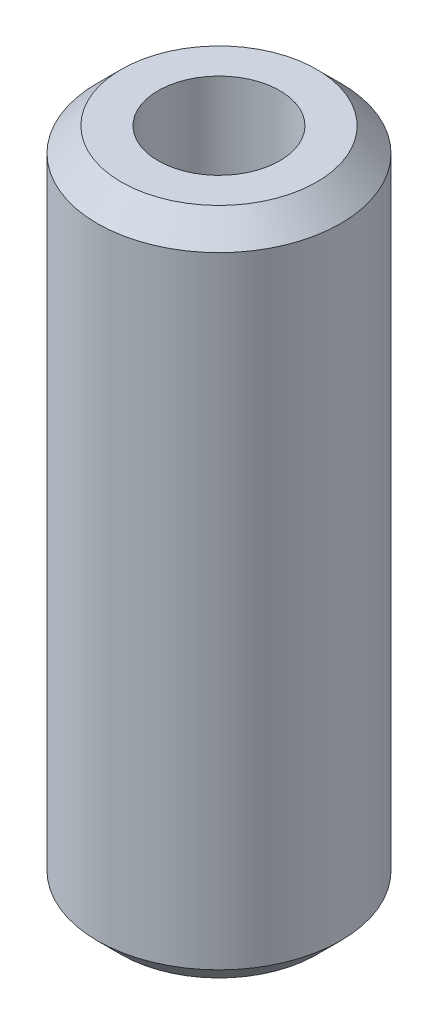
ISO-10303-21;
HEADER;
FILE_DESCRIPTION(('STEP AP214'),'2;1');
FILE_NAME('part.step','',(''),(''),'','','');
FILE_SCHEMA(('AUTOMOTIVE_DESIGN { 1 0 10303 214 1 1 1 1 }'));
ENDSEC;
DATA;
#1=APPLICATION_CONTEXT('core data for automotive mechanical design processes');
#2=APPLICATION_PROTOCOL_DEFINITION('international standard','automotive_design',2000,#1);
#3=PRODUCT_CONTEXT('',#1,'mechanical');
#4=PRODUCT('Part','Part','',(#3));
#5=PRODUCT_RELATED_PRODUCT_CATEGORY('part','',(#4));
#6=PRODUCT_DEFINITION_FORMATION('','',#4);
#7=PRODUCT_DEFINITION_CONTEXT('part definition',#1,'design');
#8=PRODUCT_DEFINITION('design','',#6,#7);
#9=PRODUCT_DEFINITION_SHAPE('','',#8);
#10=(LENGTH_UNIT() NAMED_UNIT(*) SI_UNIT(.MILLI.,.METRE.));
#11=(NAMED_UNIT(*) PLANE_ANGLE_UNIT() SI_UNIT($,.RADIAN.));
#12=(NAMED_UNIT(*) SI_UNIT($,.STERADIAN.) SOLID_ANGLE_UNIT());
#13=UNCERTAINTY_MEASURE_WITH_UNIT(LENGTH_MEASURE(1.E-05),#10,'distance_accuracy_value','');
#14=(GEOMETRIC_REPRESENTATION_CONTEXT(3) GLOBAL_UNCERTAINTY_ASSIGNED_CONTEXT((#13)) GLOBAL_UNIT_ASSIGNED_CONTEXT((#10,
#11,#12)) REPRESENTATION_CONTEXT('',''));
#15=CARTESIAN_POINT('',(0.,0.,0.));
#16=DIRECTION('',(0.,0.,1.));
#17=DIRECTION('',(1.,0.,0.));
#18=AXIS2_PLACEMENT_3D('',#15,#16,#17);
#19=CARTESIAN_POINT('',(0.,34.925,0.));
#20=DIRECTION('',(0.,1.,0.));
#21=DIRECTION('',(0.,0.,1.));
#22=AXIS2_PLACEMENT_3D('',#19,#20,#21);
#23=PLANE('',#22);
#24=CARTESIAN_POINT('',(0.,34.925,0.));
#25=DIRECTION('',(0.,1.,0.));
#26=DIRECTION('',(0.,0.,1.));
#27=AXIS2_PLACEMENT_3D('',#24,#25,#26);
#28=CIRCLE('',#27,10.2);
#29=CARTESIAN_POINT('',(0.,34.925,10.2));
#30=VERTEX_POINT('',#29);
#31=EDGE_CURVE('E45',#30,#30,#28,.T.);
#32=ORIENTED_EDGE('',*,*,#31,.T.);
#33=EDGE_LOOP('',(#32));
#34=FACE_BOUND('',#33,.T.);
#35=CARTESIAN_POINT('',(0.,34.925,0.));
#36=DIRECTION('',(0.,1.,0.));
#37=DIRECTION('',(0.,0.,1.));
#38=AXIS2_PLACEMENT_3D('',#35,#36,#37);
#39=CIRCLE('',#38,6.35);
#40=CARTESIAN_POINT('',(0.,34.925,6.35));
#41=VERTEX_POINT('',#40);
#42=EDGE_CURVE('E50',#41,#41,#39,.T.);
#43=ORIENTED_EDGE('',*,*,#42,.F.);
#44=EDGE_LOOP('',(#43));
#45=FACE_BOUND('',#44,.T.);
#46=ADVANCED_FACE('F30',(#34,#45),#23,.T.);
#47=CARTESIAN_POINT('',(0.,-34.925,0.));
#48=DIRECTION('',(0.,1.,0.));
#49=DIRECTION('',(0.,0.,1.));
#50=AXIS2_PLACEMENT_3D('',#47,#48,#49);
#51=PLANE('',#50);
#52=CARTESIAN_POINT('',(0.,-34.925,0.));
#53=DIRECTION('',(0.,1.,0.));
#54=DIRECTION('',(0.,0.,1.));
#55=AXIS2_PLACEMENT_3D('',#52,#53,#54);
#56=CIRCLE('',#55,10.2);
#57=CARTESIAN_POINT('',(0.,-34.925,10.2));
#58=VERTEX_POINT('',#57);
#59=EDGE_CURVE('E10',#58,#58,#56,.F.);
#60=ORIENTED_EDGE('',*,*,#59,.T.);
#61=EDGE_LOOP('',(#60));
#62=FACE_BOUND('',#61,.T.);
#63=CARTESIAN_POINT('',(0.,-34.925,0.));
#64=DIRECTION('',(0.,1.,0.));
#65=DIRECTION('',(0.,0.,1.));
#66=AXIS2_PLACEMENT_3D('',#63,#64,#65);
#67=CIRCLE('',#66,6.35);
#68=CARTESIAN_POINT('',(0.,-34.925,6.35));
#69=VERTEX_POINT('',#68);
#70=EDGE_CURVE('E51',#69,#69,#67,.T.);
#71=ORIENTED_EDGE('',*,*,#70,.T.);
#72=EDGE_LOOP('',(#71));
#73=FACE_BOUND('',#72,.T.);
#74=ADVANCED_FACE('F61',(#62,#73),#51,.F.);
#75=CARTESIAN_POINT('',(0.,34.925,0.));
#76=DIRECTION('',(0.,-1.,0.));
#77=DIRECTION('',(0.,0.,-1.));
#78=AXIS2_PLACEMENT_3D('',#75,#76,#77);
#79=CYLINDRICAL_SURFACE('',#78,12.7);
#80=CARTESIAN_POINT('',(0.,32.425,0.));
#81=DIRECTION('',(0.,1.,0.));
#82=DIRECTION('',(0.,0.,1.));
#83=AXIS2_PLACEMENT_3D('',#80,#81,#82);
#84=CIRCLE('',#83,12.7);
#85=CARTESIAN_POINT('',(0.,32.425,12.7));
#86=VERTEX_POINT('',#85);
#87=EDGE_CURVE('E37',#86,#86,#84,.F.);
#88=ORIENTED_EDGE('',*,*,#87,.T.);
#89=EDGE_LOOP('',(#88));
#90=FACE_BOUND('',#89,.T.);
#91=CARTESIAN_POINT('',(0.,-32.425,0.));
#92=DIRECTION('',(0.,1.,0.));
#93=DIRECTION('',(0.,0.,1.));
#94=AXIS2_PLACEMENT_3D('',#91,#92,#93);
#95=CIRCLE('',#94,12.7);
#96=CARTESIAN_POINT('',(0.,-32.425,12.7));
#97=VERTEX_POINT('',#96);
#98=EDGE_CURVE('E41',#97,#97,#95,.T.);
#99=ORIENTED_EDGE('',*,*,#98,.T.);
#100=EDGE_LOOP('',(#99));
#101=FACE_BOUND('',#100,.T.);
#102=ADVANCED_FACE('F67',(#90,#101),#79,.T.);
#103=CARTESIAN_POINT('',(0.,34.925,0.));
#104=DIRECTION('',(0.,-1.,0.));
#105=DIRECTION('',(0.,0.,-1.));
#106=AXIS2_PLACEMENT_3D('',#103,#104,#105);
#107=CYLINDRICAL_SURFACE('',#106,6.35);
#108=ORIENTED_EDGE('',*,*,#42,.T.);
#109=EDGE_LOOP('',(#108));
#110=FACE_BOUND('',#109,.T.);
#111=ORIENTED_EDGE('',*,*,#70,.F.);
#112=EDGE_LOOP('',(#111));
#113=FACE_BOUND('',#112,.T.);
#114=ADVANCED_FACE('F57',(#110,#113),#107,.F.);
#115=CARTESIAN_POINT('',(0.,34.925,0.));
#116=DIRECTION('',(0.,-1.,0.));
#117=DIRECTION('',(0.,0.,-1.));
#118=AXIS2_PLACEMENT_3D('',#115,#116,#117);
#119=CONICAL_SURFACE('',#118,10.2,0.785398163397446);
#120=ORIENTED_EDGE('',*,*,#87,.F.);
#121=EDGE_LOOP('',(#120));
#122=FACE_BOUND('',#121,.T.);
#123=ORIENTED_EDGE('',*,*,#31,.F.);
#124=EDGE_LOOP('',(#123));
#125=FACE_BOUND('',#124,.T.);
#126=ADVANCED_FACE('F72',(#122,#125),#119,.T.);
#127=CARTESIAN_POINT('',(0.,-32.425,0.));
#128=DIRECTION('',(0.,1.,0.));
#129=DIRECTION('',(0.,0.,1.));
#130=AXIS2_PLACEMENT_3D('',#127,#128,#129);
#131=CONICAL_SURFACE('',#130,12.7,0.785398163397449);
#132=ORIENTED_EDGE('',*,*,#59,.F.);
#133=EDGE_LOOP('',(#132));
#134=FACE_BOUND('',#133,.T.);
#135=ORIENTED_EDGE('',*,*,#98,.F.);
#136=EDGE_LOOP('',(#135));
#137=FACE_BOUND('',#136,.T.);
#138=ADVANCED_FACE('F32',(#134,#137),#131,.T.);
#139=CLOSED_SHELL('',(#46,#74,#102,#114,#126,#138));
#140=MANIFOLD_SOLID_BREP('B2',#139);
#141=ADVANCED_BREP_SHAPE_REPRESENTATION('',(#18,#140),#14);
#142=SHAPE_DEFINITION_REPRESENTATION(#9,#141);
ENDSEC;
END-ISO-10303-21;
